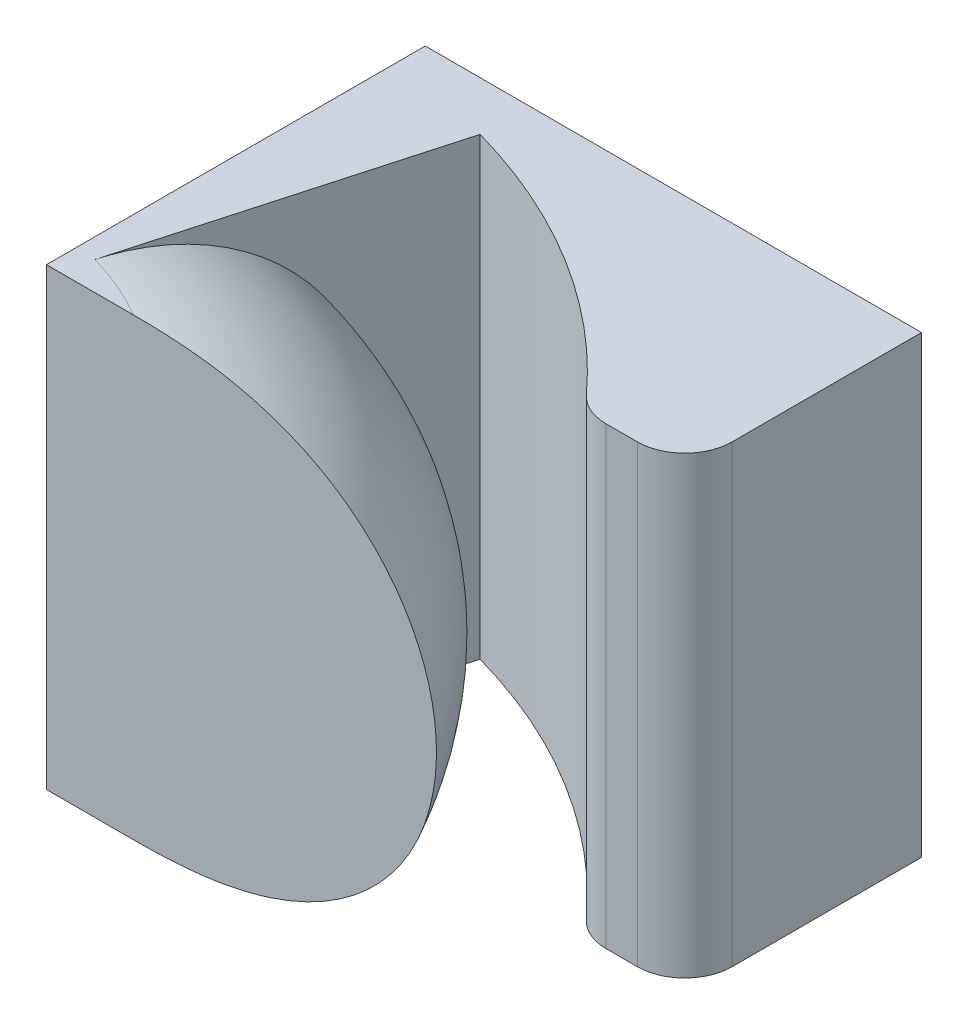
ISO-10303-21;
HEADER;
FILE_DESCRIPTION(('STEP AP214'),'2;1');
FILE_NAME('part.step','',(''),(''),'','','');
FILE_SCHEMA(('AUTOMOTIVE_DESIGN { 1 0 10303 214 1 1 1 1 }'));
ENDSEC;
DATA;
#1=APPLICATION_CONTEXT('core data for automotive mechanical design processes');
#2=APPLICATION_PROTOCOL_DEFINITION('international standard','automotive_design',2000,#1);
#3=PRODUCT_CONTEXT('',#1,'mechanical');
#4=PRODUCT('Part','Part','',(#3));
#5=PRODUCT_RELATED_PRODUCT_CATEGORY('part','',(#4));
#6=PRODUCT_DEFINITION_FORMATION('','',#4);
#7=PRODUCT_DEFINITION_CONTEXT('part definition',#1,'design');
#8=PRODUCT_DEFINITION('design','',#6,#7);
#9=PRODUCT_DEFINITION_SHAPE('','',#8);
#10=(LENGTH_UNIT() NAMED_UNIT(*) SI_UNIT(.MILLI.,.METRE.));
#11=(NAMED_UNIT(*) PLANE_ANGLE_UNIT() SI_UNIT($,.RADIAN.));
#12=(NAMED_UNIT(*) SI_UNIT($,.STERADIAN.) SOLID_ANGLE_UNIT());
#13=UNCERTAINTY_MEASURE_WITH_UNIT(LENGTH_MEASURE(1.E-05),#10,'distance_accuracy_value','');
#14=(GEOMETRIC_REPRESENTATION_CONTEXT(3) GLOBAL_UNCERTAINTY_ASSIGNED_CONTEXT((#13)) GLOBAL_UNIT_ASSIGNED_CONTEXT((#10,
#11,#12)) REPRESENTATION_CONTEXT('',''));
#15=CARTESIAN_POINT('',(0.,0.,0.));
#16=DIRECTION('',(0.,0.,1.));
#17=DIRECTION('',(1.,0.,0.));
#18=AXIS2_PLACEMENT_3D('',#15,#16,#17);
#19=CARTESIAN_POINT('',(-4.71016791571403,24.,54.4174156406722));
#20=CARTESIAN_POINT('',(-5.27005482536407,24.,53.1047949183662));
#21=CARTESIAN_POINT('',(-5.76901576654429,24.,52.0880987101162));
#22=CARTESIAN_POINT('',(-7.40660589628675,24.,49.0371312255311));
#23=CARTESIAN_POINT('',(-8.99268635291087,24.,46.8458162772862));
#24=CARTESIAN_POINT('',(-12.6754718655559,24.,43.0024173611818));
#25=CARTESIAN_POINT('',(-14.7414143760531,24.,41.3604226096504));
#26=CARTESIAN_POINT('',(-19.2517447823683,24.,38.6796599592442));
#27=CARTESIAN_POINT('',(-21.6643200628094,24.,37.6518689018373));
#28=CARTESIAN_POINT('',(-24.6725841187333,24.,36.8101417771892));
#29=CARTESIAN_POINT('',(-25.3661956648907,24.,36.6349138030031));
#30=CARTESIAN_POINT('',(-26.8098678951183,24.,36.3282053579318));
#31=CARTESIAN_POINT('',(-27.4924899255827,24.,36.1976048050057));
#32=CARTESIAN_POINT('',(-29.0079207203546,24.,35.9377611325429));
#33=CARTESIAN_POINT('',(-29.7761456367745,24.,35.8228215415974));
#34=CARTESIAN_POINT('',(-30.5418990481113,24.,35.7253963453148));
#35=CARTESIAN_POINT('',(9.75452794311762,24.,47.5783679210332));
#36=CARTESIAN_POINT('',(9.16204061197921,23.9999999999893,46.1968231293004));
#37=CARTESIAN_POINT('',(8.54959443107939,23.9999999999973,44.9329791196848));
#38=CARTESIAN_POINT('',(5.9982738253789,24.0000000000084,40.1796552817696));
#39=CARTESIAN_POINT('',(3.56332674649019,24.0000000000084,36.8248538745915));
#40=CARTESIAN_POINT('',(-2.11027866995525,23.9999999999916,30.9007709786547));
#41=CARTESIAN_POINT('',(-5.33816918219462,24.0000000000625,28.335446555197));
#42=CARTESIAN_POINT('',(-12.2871932178729,24.0000000000789,24.2074174795956));
#43=CARTESIAN_POINT('',(-15.9839556701884,23.9999999999919,22.6267377641538));
#44=CARTESIAN_POINT('',(-20.6707487354631,24.0000000000018,21.3153499385741));
#45=CARTESIAN_POINT('',(-21.5869887851796,23.9999999999988,21.0870461091565));
#46=CARTESIAN_POINT('',(-23.2599666358186,24.000000000002,20.7266660074943));
#47=CARTESIAN_POINT('',(-23.991783584877,24.,20.5852680777272));
#48=CARTESIAN_POINT('',(-25.5105776333262,24.,20.3246706536647));
#49=CARTESIAN_POINT('',(-26.2759363030982,23.9999999999866,20.2102543276948));
#50=CARTESIAN_POINT('',(-27.0429190010063,24.,20.1126727318654));
#51=CARTESIAN_POINT('',(27.8353977666572,12.,39.0295582714846));
#52=CARTESIAN_POINT('',(27.2021584929589,12.0000000000067,37.5618512843462));
#53=CARTESIAN_POINT('',(26.4478571781077,11.999999999996,35.9890796316548));
#54=CARTESIAN_POINT('',(22.7543734774652,12.0000000000125,29.1078103520384));
#55=CARTESIAN_POINT('',(19.2583431207781,12.0000000000042,24.2986508712356));
#56=CARTESIAN_POINT('',(11.096212824509,11.9999999999958,15.7737130004833));
#57=CARTESIAN_POINT('',(6.41588731018894,12.0000000000713,12.0542264870076));
#58=CARTESIAN_POINT('',(-3.58150376217878,12.0000000000878,6.11711437992878));
#59=CARTESIAN_POINT('',(-8.88350017945063,11.9999999999959,3.84532384205558));
#60=CARTESIAN_POINT('',(-15.6684545063665,12.0000000000009,1.9468601403038));
#61=CARTESIAN_POINT('',(-16.8629801855233,11.9999999999979,1.6522114918527));
#62=CARTESIAN_POINT('',(-18.8225900617061,12.0000000000027,1.22474181944225));
#63=CARTESIAN_POINT('',(-19.6159006590349,11.999999999998,1.06984716861948));
#64=CARTESIAN_POINT('',(-21.1388987745007,12.000000000002,0.808307555076578));
#65=CARTESIAN_POINT('',(-21.9006746360384,11.9999999999766,0.694545310352749));
#66=CARTESIAN_POINT('',(-22.6691939421252,12.,0.596768215053585));
#67=CARTESIAN_POINT('',(27.8353977666572,-12.,39.0295582714846));
#68=CARTESIAN_POINT('',(27.2021584929316,-11.9999999999786,37.5618512843521));
#69=CARTESIAN_POINT('',(26.447857178113,-12.000000000004,35.9890796316602));
#70=CARTESIAN_POINT('',(22.7543734774484,-11.9999999999875,29.1078103520216));
#71=CARTESIAN_POINT('',(19.2583431208032,-12.0000000000125,24.298650871269));
#72=CARTESIAN_POINT('',(11.0962128244839,-11.9999999999875,15.7737130004499));
#73=CARTESIAN_POINT('',(6.41588731018894,-12.0000000000755,12.0542264870076));
#74=CARTESIAN_POINT('',(-3.58150376217878,-12.0000000000837,6.11711437992878));
#75=CARTESIAN_POINT('',(-8.88350017953178,-11.9999999999878,3.84532384202312));
#76=CARTESIAN_POINT('',(-15.6684545063481,-12.0000000000028,1.94686014031116));
#77=CARTESIAN_POINT('',(-16.8629801854827,-12.0000000000034,1.65221149186375));
#78=CARTESIAN_POINT('',(-18.8225900617353,-11.9999999999987,1.22474181943427));
#79=CARTESIAN_POINT('',(-19.6159006591205,-12.000000000002,1.06984716860077));
#80=CARTESIAN_POINT('',(-21.1388987744152,-11.999999999998,0.808307555095281));
#81=CARTESIAN_POINT('',(-21.9006746361035,-11.9999999999987,0.694545310344979));
#82=CARTESIAN_POINT('',(-22.6691939421252,-12.,0.596768215053578));
#83=CARTESIAN_POINT('',(9.75452794311767,-24.,47.5783679210333));
#84=CARTESIAN_POINT('',(9.16204061195063,-23.999999999984,46.1968231293019));
#85=CARTESIAN_POINT('',(8.5495944310874,-24.0000000000027,44.9329791196955));
#86=CARTESIAN_POINT('',(5.99827382535381,-23.9999999999917,40.1796552817361));
#87=CARTESIAN_POINT('',(3.56332674654871,-24.0000000000084,36.8248538746584));
#88=CARTESIAN_POINT('',(-2.11027867001382,-23.9999999999916,30.9007709785878));
#89=CARTESIAN_POINT('',(-5.33816918219462,-24.0000000000625,28.335446555197));
#90=CARTESIAN_POINT('',(-12.2871932178729,-24.0000000000789,24.2074174795956));
#91=CARTESIAN_POINT('',(-15.9839556703507,-23.9999999999919,22.6267377640889));
#92=CARTESIAN_POINT('',(-20.6707487354263,-24.0000000000018,21.3153499385888));
#93=CARTESIAN_POINT('',(-21.5869887850984,-24.0000000000006,21.0870461091786));
#94=CARTESIAN_POINT('',(-23.2599666358771,-24.0000000000006,20.7266660074783));
#95=CARTESIAN_POINT('',(-23.9917835850481,-24.,20.5852680776898));
#96=CARTESIAN_POINT('',(-25.5105776331553,-24.,20.3246706537021));
#97=CARTESIAN_POINT('',(-26.2759363032282,-23.9999999999933,20.2102543276782));
#98=CARTESIAN_POINT('',(-27.0429190010064,-24.,20.1126727318654));
#99=CARTESIAN_POINT('',(-4.71016791571399,-24.,54.4174156406722));
#100=CARTESIAN_POINT('',(-5.2700548253937,-24.,53.1047949183681));
#101=CARTESIAN_POINT('',(-5.76901576653627,-24.,52.0880987101269));
#102=CARTESIAN_POINT('',(-7.40660589631184,-24.,49.0371312254977));
#103=CARTESIAN_POINT('',(-8.99268635285235,-24.,46.8458162773531));
#104=CARTESIAN_POINT('',(-12.6754718656145,-24.,43.0024173611149));
#105=CARTESIAN_POINT('',(-14.7414143760531,-24.,41.3604226096504));
#106=CARTESIAN_POINT('',(-19.2517447823683,-24.,38.6796599592442));
#107=CARTESIAN_POINT('',(-21.6643200629717,-24.,37.6518689017723));
#108=CARTESIAN_POINT('',(-24.6725841186965,-24.,36.8101417772039));
#109=CARTESIAN_POINT('',(-25.3661956648096,-24.,36.6349138030252));
#110=CARTESIAN_POINT('',(-26.8098678951768,-24.,36.3282053579159));
#111=CARTESIAN_POINT('',(-27.4924899257539,-24.,36.1976048049683));
#112=CARTESIAN_POINT('',(-29.0079207201836,-24.,35.9377611325803));
#113=CARTESIAN_POINT('',(-29.7761456369045,-24.,35.8228215415808));
#114=CARTESIAN_POINT('',(-30.5418990481114,-24.,35.7253963453148));
#115=(BOUNDED_SURFACE() B_SPLINE_SURFACE(5,3,((#19,#20,#21,#22,#23,#24,#25,#26,#27,#28,#29,#30,
#31,#32,#33,#34),(#35,#36,#37,#38,#39,#40,#41,#42,#43,#44,#45,#46,#47,#48,#49,#50),(#51,#52,#53,
#54,#55,#56,#57,#58,#59,#60,#61,#62,#63,#64,#65,#66),(#67,#68,#69,#70,#71,#72,#73,#74,#75,#76,
#77,#78,#79,#80,#81,#82),(#83,#84,#85,#86,#87,#88,#89,#90,#91,#92,#93,#94,#95,#96,#97,#98),(#99,
#100,#101,#102,#103,#104,#105,#106,#107,#108,#109,#110,#111,#112,#113,#114)),.UNSPECIFIED.,.F.,
.F.,.F.) B_SPLINE_SURFACE_WITH_KNOTS((6,6),(4,2,2,2,2,2,2,4),(0.,1.),(-0.107384987562366,0.,
0.336639506012491,0.673279012024983,1.,1.07384987562366,1.12754236940485,1.18123486318603),
.UNSPECIFIED.) GEOMETRIC_REPRESENTATION_ITEM() RATIONAL_B_SPLINE_SURFACE(((1.,1.,1.,1.,1.,1.,1.,
1.,1.,1.,1.,1.,1.,1.,1.,1.),(0.6,0.6,0.6,0.6,0.6,0.6,0.59999999999823,0.59999999999823,0.6,0.6,
0.599999999999985,0.599999999999985,0.6,0.6,0.6,0.6),(0.4,0.4,0.4,0.4,0.4,0.4,0.399999999997344,
0.399999999997344,0.4,0.4,0.399999999999977,0.399999999999977,0.4,0.4,0.4,0.4),(0.4,0.4,0.4,0.4,
0.4,0.4,0.399999999997344,0.399999999997344,0.4,0.4,0.399999999999977,0.399999999999977,0.4,0.4,
0.4,0.4),(0.6,0.6,0.6,0.6,0.6,0.6,0.59999999999823,0.59999999999823,0.6,0.6,0.599999999999985,
0.599999999999985,0.6,0.6,0.6,0.6),(1.,1.,1.,1.,1.,1.,1.,1.,1.,1.,1.,1.,1.,1.,1.,1.))) REPRESENTATION_ITEM('') SURFACE());
#116=CARTESIAN_POINT('',(-4.71016791571399,-24.,54.4174156406722));
#117=CARTESIAN_POINT('',(-5.2700548253937,-24.,53.1047949183681));
#118=CARTESIAN_POINT('',(-5.76901576653627,-24.,52.0880987101269));
#119=CARTESIAN_POINT('',(-7.40660589631184,-24.,49.0371312254977));
#120=CARTESIAN_POINT('',(-8.99268635285235,-24.,46.8458162773531));
#121=CARTESIAN_POINT('',(-12.6754718656145,-24.,43.0024173611149));
#122=CARTESIAN_POINT('',(-14.7414143760531,-24.,41.3604226096504));
#123=CARTESIAN_POINT('',(-19.2517447823683,-24.,38.6796599592442));
#124=CARTESIAN_POINT('',(-21.6643200629717,-24.,37.6518689017723));
#125=CARTESIAN_POINT('',(-24.6725841186965,-24.,36.8101417772039));
#126=CARTESIAN_POINT('',(-25.3661956648096,-24.,36.6349138030252));
#127=CARTESIAN_POINT('',(-26.8098678951768,-24.,36.3282053579159));
#128=CARTESIAN_POINT('',(-27.4924899257539,-24.,36.1976048049683));
#129=CARTESIAN_POINT('',(-29.0079207201836,-24.,35.9377611325803));
#130=CARTESIAN_POINT('',(-29.7761456369045,-24.,35.8228215415808));
#131=CARTESIAN_POINT('',(-30.5418990481114,-24.,35.7253963453148));
#132=(BOUNDED_CURVE() B_SPLINE_CURVE(3,(#116,#117,#118,#119,#120,#121,#122,#123,#124,#125,#126,
#127,#128,#129,#130,#131),.UNSPECIFIED.,.F.,.F.) B_SPLINE_CURVE_WITH_KNOTS((4,2,2,2,2,2,2,4),
(-0.107384987562366,0.,0.336639506012491,0.673279012024983,1.,1.07384987562366,1.12754236940485,
1.18123486318603),
.UNSPECIFIED.) CURVE() GEOMETRIC_REPRESENTATION_ITEM() RATIONAL_B_SPLINE_CURVE((1.,1.,1.,1.,1.,
1.,1.,1.,1.,1.,1.,1.,1.,1.,1.,1.)) REPRESENTATION_ITEM(''));
#133=CARTESIAN_POINT('',(-24.1179758170278,-24.,36.9653239162641));
#134=VERTEX_POINT('',#133);
#135=CARTESIAN_POINT('',(-17.0302986459175,-24.,40.));
#136=VERTEX_POINT('',#135);
#137=EDGE_CURVE('E252',#134,#136,#132,.F.);
#138=CARTESIAN_POINT('',(-24.1179758170278,-24.,36.9653239162642));
#139=CARTESIAN_POINT('',(-19.8066841806051,-24.,21.5571194645536));
#140=CARTESIAN_POINT('',(-14.4175696350769,-12.,2.29686389991545));
#141=CARTESIAN_POINT('',(-14.4175696350769,12.,2.29686389991543));
#142=CARTESIAN_POINT('',(-19.8066841806052,24.,21.5571194645536));
#143=CARTESIAN_POINT('',(-24.1179758170279,24.,36.9653239162641));
#144=(BOUNDED_CURVE() B_SPLINE_CURVE(5,(#138,#139,#140,#141,#142,#143),.UNSPECIFIED.,.F.,
.F.) B_SPLINE_CURVE_WITH_KNOTS((6,6),(0.,1.),
.UNSPECIFIED.) CURVE() GEOMETRIC_REPRESENTATION_ITEM() RATIONAL_B_SPLINE_CURVE((1.,0.6,0.4,0.4,
0.6,1.)) REPRESENTATION_ITEM(''));
#145=CARTESIAN_POINT('',(-24.1179758170278,24.,36.9653239162641));
#146=VERTEX_POINT('',#145);
#147=EDGE_CURVE('E128',#146,#134,#144,.F.);
#148=CARTESIAN_POINT('',(-30.5418990481113,24.,35.7253963453148));
#149=CARTESIAN_POINT('',(-29.7761456367745,24.,35.8228215415974));
#150=CARTESIAN_POINT('',(-29.0079207203546,24.,35.9377611325429));
#151=CARTESIAN_POINT('',(-27.4924899255827,24.,36.1976048050057));
#152=CARTESIAN_POINT('',(-26.8098678951183,24.,36.3282053579318));
#153=CARTESIAN_POINT('',(-25.3661956648907,24.,36.6349138030031));
#154=CARTESIAN_POINT('',(-24.6725841187333,24.,36.8101417771892));
#155=CARTESIAN_POINT('',(-21.6643200628094,24.,37.6518689018373));
#156=CARTESIAN_POINT('',(-19.2517447823683,24.,38.6796599592442));
#157=CARTESIAN_POINT('',(-14.7414143760531,24.,41.3604226096504));
#158=CARTESIAN_POINT('',(-12.6754718655559,24.,43.0024173611818));
#159=CARTESIAN_POINT('',(-8.99268635291087,24.,46.8458162772862));
#160=CARTESIAN_POINT('',(-7.40660589628675,24.,49.0371312255311));
#161=CARTESIAN_POINT('',(-5.76901576654429,24.,52.0880987101162));
#162=CARTESIAN_POINT('',(-5.27005482536407,24.,53.1047949183662));
#163=CARTESIAN_POINT('',(-4.71016791571403,24.,54.4174156406722));
#164=(BOUNDED_CURVE() B_SPLINE_CURVE(3,(#148,#149,#150,#151,#152,#153,#154,#155,#156,#157,#158,
#159,#160,#161,#162,#163),.UNSPECIFIED.,.F.,.F.) B_SPLINE_CURVE_WITH_KNOTS((4,2,2,2,2,2,2,4),
(-0.107384987562366,-0.0536924937811831,0.,0.0738498756236627,0.40057086359868,
0.737210369611172,1.07384987562366,1.18123486318603),
.UNSPECIFIED.) CURVE() GEOMETRIC_REPRESENTATION_ITEM() RATIONAL_B_SPLINE_CURVE((1.,1.,1.,1.,1.,
1.,1.,1.,1.,1.,1.,1.,1.,1.,1.,1.)) REPRESENTATION_ITEM(''));
#165=CARTESIAN_POINT('',(-17.0302986457471,24.,40.));
#166=VERTEX_POINT('',#165);
#167=EDGE_CURVE('E165',#166,#146,#164,.F.);
#168=CARTESIAN_POINT('',(-17.0302986457905,24.,40.0000000000733));
#169=CARTESIAN_POINT('',(-16.1644996832486,24.0000857948899,40.0000989992136));
#170=CARTESIAN_POINT('',(-15.2982382123024,23.9877939427651,40.0005160881803));
#171=CARTESIAN_POINT('',(-13.5327217107944,23.9285043746845,40.001376924711));
#172=CARTESIAN_POINT('',(-12.6335140141017,23.8801559127451,40.0018210747047));
#173=CARTESIAN_POINT('',(-11.2702926318957,23.7716593624574,40.0019697989966));
#174=CARTESIAN_POINT('',(-10.8049528704081,23.7283675044395,40.0019273216198));
#175=CARTESIAN_POINT('',(-9.86207930953182,23.6266361864235,40.0016842571246));
#176=CARTESIAN_POINT('',(-9.38458908570482,23.5677889236964,40.0014790597406));
#177=CARTESIAN_POINT('',(-8.416493168563,23.4321868863049,40.0009912146743));
#178=CARTESIAN_POINT('',(-7.92595908433239,23.3549174304994,40.0007062900602));
#179=CARTESIAN_POINT('',(-6.93112928689655,23.1793316477198,40.0001873362531));
#180=CARTESIAN_POINT('',(-6.42694492771486,23.0803794018241,39.9999554100463));
#181=CARTESIAN_POINT('',(-5.49682034431617,22.8780024232116,40.0000380361861));
#182=CARTESIAN_POINT('',(-5.07027165237416,22.7773726858346,40.0002772781295));
#183=CARTESIAN_POINT('',(-4.21375542790418,22.5584793507755,40.0009249498853));
#184=CARTESIAN_POINT('',(-3.78385854951048,22.4399381583427,40.001336265167));
#185=CARTESIAN_POINT('',(-2.92124716444559,22.1835078963742,40.0020783995394));
#186=CARTESIAN_POINT('',(-2.48862629276785,22.0453030359022,40.0024075987347));
#187=CARTESIAN_POINT('',(-1.6213642963441,21.7477512248954,40.0028615252165));
#188=CARTESIAN_POINT('',(-1.18684512116715,21.5880479344405,40.0029821866281));
#189=CARTESIAN_POINT('',(-0.316826051316081,21.2456564775207,40.0029736070605));
#190=CARTESIAN_POINT('',(0.118517586916658,21.0625704163697,40.0028392878277));
#191=CARTESIAN_POINT('',(0.988872707372866,20.6715493038597,40.0023724251945));
#192=CARTESIAN_POINT('',(1.42368726180994,20.4631750464913,40.0020357994184));
#193=CARTESIAN_POINT('',(2.29135606592329,20.0197254029624,40.0012866930284));
#194=CARTESIAN_POINT('',(2.72396598680997,19.7841712441339,40.0008727336127));
#195=CARTESIAN_POINT('',(3.58528099457577,19.284587103109,40.000251495007));
#196=CARTESIAN_POINT('',(4.01368843428267,19.0200428056821,40.0000489862116));
#197=CARTESIAN_POINT('',(4.81236484056924,18.4948506231412,39.999955949328));
#198=CARTESIAN_POINT('',(5.18414257897818,18.2364956281938,40.0000360437722));
#199=CARTESIAN_POINT('',(5.91745484696259,17.6975890690435,40.0001844311617));
#200=CARTESIAN_POINT('',(6.27883613710342,17.4168286006517,40.0002525878652));
#201=CARTESIAN_POINT('',(6.98941121312907,16.8328198815751,40.0003845906144));
#202=CARTESIAN_POINT('',(7.33843472369428,16.5293644046325,40.000448383169));
#203=CARTESIAN_POINT('',(8.02225375897534,15.8998139578739,40.0005326839744));
#204=CARTESIAN_POINT('',(8.35686295576284,15.5735158986797,40.0005527339099));
#205=CARTESIAN_POINT('',(8.8451873691633,15.068518850507,40.0005488319176));
#206=CARTESIAN_POINT('',(9.00628876715931,14.8969062698749,40.0005417751843));
#207=CARTESIAN_POINT('',(9.3240887943153,14.5480674214161,40.0005169235237));
#208=CARTESIAN_POINT('',(9.48076139133972,14.3708173814594,40.0004990750984));
#209=CARTESIAN_POINT('',(9.7894133054607,14.0107652567126,40.000454466436));
#210=CARTESIAN_POINT('',(9.94136578821857,13.827940176438,40.0004276628536));
#211=CARTESIAN_POINT('',(10.2402935052756,13.4568091650839,40.0003679380666));
#212=CARTESIAN_POINT('',(10.3872412380589,13.2684810747629,40.0003349880149));
#213=CARTESIAN_POINT('',(10.6758715314815,12.8864355284467,40.0002666870945));
#214=CARTESIAN_POINT('',(10.8175260123406,12.6926968550588,40.0002313256423));
#215=CARTESIAN_POINT('',(11.0952824804048,12.2999396792352,40.0001630225135));
#216=CARTESIAN_POINT('',(11.2313559260144,12.1009009877108,40.0001300927173));
#217=CARTESIAN_POINT('',(11.497663606681,11.6976725615059,40.000071679374));
#218=CARTESIAN_POINT('',(11.627868959542,11.4934637490016,40.0000462298376));
#219=CARTESIAN_POINT('',(11.8821579049809,11.0800430341896,40.0000112223543));
#220=CARTESIAN_POINT('',(12.0062124159351,10.8708132378511,40.0000017339911));
#221=CARTESIAN_POINT('',(12.2412593393311,10.4591756617826,39.9999983544156));
#222=CARTESIAN_POINT('',(12.3525952466647,10.2569639413621,40.0000036926542));
#223=CARTESIAN_POINT('',(12.5691956200154,9.84857932803517,40.0000181814018));
#224=CARTESIAN_POINT('',(12.6744420007783,9.64239683971462,40.0000273426633));
#225=CARTESIAN_POINT('',(12.8786515993114,9.22625577058013,40.000048901735));
#226=CARTESIAN_POINT('',(12.9775971845964,9.01628853603016,40.0000613081709));
#227=CARTESIAN_POINT('',(13.1690009577651,8.59277598561921,40.0000867041861));
#228=CARTESIAN_POINT('',(13.2614420655938,8.37922294910216,40.0000996951637));
#229=CARTESIAN_POINT('',(13.4396420739581,7.94875092118051,40.0001246473765));
#230=CARTESIAN_POINT('',(13.5253845484691,7.73182512886617,40.0001366060876));
#231=CARTESIAN_POINT('',(13.6900027932337,7.29483288322661,40.0001580870596));
#232=CARTESIAN_POINT('',(13.7688628912066,7.07476052504142,40.0001676038509));
#233=CARTESIAN_POINT('',(13.919543333348,6.63171310472891,40.0001832295864));
#234=CARTESIAN_POINT('',(13.9913488564589,6.40873300112867,40.0001893314773));
#235=CARTESIAN_POINT('',(14.1277595649363,5.96011995859079,40.0001975338969));
#236=CARTESIAN_POINT('',(14.192350874469,5.73448279971033,40.0001996268353));
#237=CARTESIAN_POINT('',(14.314186022906,5.2808166171877,40.0001996144732));
#238=CARTESIAN_POINT('',(14.3714170207118,5.05278414442519,40.0001975019387));
#239=CARTESIAN_POINT('',(14.4783987804472,4.5945984935586,40.0001892753879));
#240=CARTESIAN_POINT('',(14.5281378199954,4.36444257796021,40.0001831551792));
#241=CARTESIAN_POINT('',(14.6200181098862,3.9022903921082,40.0001675049252));
#242=CARTESIAN_POINT('',(14.6621488340322,3.67029202881696,40.0001579702093));
#243=CARTESIAN_POINT('',(14.7387109121218,3.20474341118302,40.0001364755589));
#244=CARTESIAN_POINT('',(14.7731330060794,2.97119163374826,40.0001245127402));
#245=CARTESIAN_POINT('',(14.834192883488,2.50283161307313,40.0000995366127));
#246=CARTESIAN_POINT('',(14.8608227348954,2.26802233557856,40.0000865222507));
#247=CARTESIAN_POINT('',(14.906230394982,1.79744849114775,40.0000612014642));
#248=CARTESIAN_POINT('',(14.9250016522354,1.5616832919447,40.0000488956377));
#249=CARTESIAN_POINT('',(14.9546420625301,1.08950325436828,40.0000271313806));
#250=CARTESIAN_POINT('',(14.9655060877274,0.853088094053591,40.0000176748));
#251=CARTESIAN_POINT('',(14.9792999839244,0.379916991536058,40.0000041033806));
#252=CARTESIAN_POINT('',(14.9822261833667,0.143160942297075,39.9999999910142));
#253=CARTESIAN_POINT('',(14.9801292257424,-0.330702544190621,40.0000000090005));
#254=CARTESIAN_POINT('',(14.9750930827339,-0.567809924068686,40.0000041528212));
#255=CARTESIAN_POINT('',(14.957058154904,-1.04159730979613,40.0000178632647));
#256=CARTESIAN_POINT('',(14.9440635397269,-1.27827747439199,40.0000274270476));
#257=CARTESIAN_POINT('',(14.9101460115621,-1.75090026268962,40.0000494335216));
#258=CARTESIAN_POINT('',(14.889228727147,-1.98684329037764,40.0000618741665));
#259=CARTESIAN_POINT('',(14.8395183392025,-2.45768499696251,40.0000874748071));
#260=CARTESIAN_POINT('',(14.8107322869058,-2.69258442042409,40.0001006341503));
#261=CARTESIAN_POINT('',(14.7453546053597,-3.16103681523905,40.0001258896057));
#262=CARTESIAN_POINT('',(14.7087714035203,-3.39459096290953,40.0001379868459));
#263=CARTESIAN_POINT('',(14.6278869534923,-3.86005667316016,40.000159724765));
#264=CARTESIAN_POINT('',(14.5835954527734,-4.09196992983167,40.000169368509));
#265=CARTESIAN_POINT('',(14.4873986385592,-4.55386491643722,40.0001851998327));
#266=CARTESIAN_POINT('',(14.435504327544,-4.78384893817065,40.0001913923458));
#267=CARTESIAN_POINT('',(14.3242221437631,-5.24160485819252,40.0001997193443));
#268=CARTESIAN_POINT('',(14.2648464553086,-5.46937971900683,40.0002018603393));
#269=CARTESIAN_POINT('',(14.1387370069908,-5.92244614595919,40.0002018824328));
#270=CARTESIAN_POINT('',(14.0720165328497,-6.14774141073054,40.0001997711072));
#271=CARTESIAN_POINT('',(13.9313673808845,-6.59558789733958,40.0001914859636));
#272=CARTESIAN_POINT('',(13.8574530034942,-6.81814361106053,40.0001853200704));
#273=CARTESIAN_POINT('',(13.7025793561917,-7.26026158159487,40.0001695261128));
#274=CARTESIAN_POINT('',(13.6216353094592,-7.47982917196265,40.0001599053951));
#275=CARTESIAN_POINT('',(13.4528780753033,-7.91573362227761,40.0001381863916));
#276=CARTESIAN_POINT('',(13.3650809376385,-8.13207669682463,40.0001260937934));
#277=CARTESIAN_POINT('',(13.1828046805536,-8.56130772828632,40.0001008595783));
#278=CARTESIAN_POINT('',(13.0883423381293,-8.77420281086853,40.0000877205854));
#279=CARTESIAN_POINT('',(12.8929330834058,-9.19632685717497,40.0000620313806));
#280=CARTESIAN_POINT('',(12.7920035740965,-9.40556387857261,40.0000494797338));
#281=CARTESIAN_POINT('',(12.5838667620932,-9.82017511867226,40.0000276704588));
#282=CARTESIAN_POINT('',(12.4766773855327,-10.0255583375541,40.0000184039147));
#283=CARTESIAN_POINT('',(12.2562349737382,-10.4322784424402,40.0000037331945));
#284=CARTESIAN_POINT('',(12.1430002873884,-10.6336252768419,39.9999983179738));
#285=CARTESIAN_POINT('',(11.9045705898737,-11.0426064683214,40.000001765441));
#286=CARTESIAN_POINT('',(11.7790609279774,-11.2500574525741,40.0000113495149));
#287=CARTESIAN_POINT('',(11.5219682547276,-11.659892650338,40.0000467386236));
#288=CARTESIAN_POINT('',(11.3904143026727,-11.8622950992118,40.0000724723127));
#289=CARTESIAN_POINT('',(11.1215155347227,-12.2618894505819,40.0001315347077));
#290=CARTESIAN_POINT('',(10.9841995341412,-12.4591007467644,40.0001648286111));
#291=CARTESIAN_POINT('',(10.7040631231206,-12.848188217783,40.000233887832));
#292=CARTESIAN_POINT('',(10.5612711464555,-13.04008486908,40.0002696409911));
#293=CARTESIAN_POINT('',(10.2704696572457,-13.4184376302108,40.0003386978595));
#294=CARTESIAN_POINT('',(10.1224880795512,-13.6049152142944,40.0003720123745));
#295=CARTESIAN_POINT('',(9.82159469075277,-13.9723424032402,40.0004323971083));
#296=CARTESIAN_POINT('',(9.6687102030794,-14.1533143919798,40.000459496764));
#297=CARTESIAN_POINT('',(9.35829418261695,-14.5096631125551,40.0005045967734));
#298=CARTESIAN_POINT('',(9.20078927692075,-14.6850630313174,40.0005226413299));
#299=CARTESIAN_POINT('',(8.88142200005761,-15.0302098957833,40.0005477653243));
#300=CARTESIAN_POINT('',(8.71958542873154,-15.1999807705296,40.0005548992728));
#301=CARTESIAN_POINT('',(8.22921113061581,-15.6994780850658,40.000558835213));
#302=CARTESIAN_POINT('',(7.89341383688496,-16.0221329293013,40.000538551011));
#303=CARTESIAN_POINT('',(7.20757352866402,-16.6444858155749,40.0004533332746));
#304=CARTESIAN_POINT('',(6.85771457030468,-16.9443873890067,40.0003888653968));
#305=CARTESIAN_POINT('',(6.14579604857627,-17.5214070678554,40.0002553173466));
#306=CARTESIAN_POINT('',(5.78390435273767,-17.7987323362777,40.0001862930736));
#307=CARTESIAN_POINT('',(5.0498691553771,-18.3309127488703,40.00003659457));
#308=CARTESIAN_POINT('',(4.67787644833724,-18.5859762663904,39.9999560526536));
#309=CARTESIAN_POINT('',(3.87984947853494,-19.1038191432649,40.0000487745688));
#310=CARTESIAN_POINT('',(3.45236734731007,-19.3643686634104,40.0002508884313));
#311=CARTESIAN_POINT('',(2.59326203297151,-19.8563055611358,40.0008709134667));
#312=CARTESIAN_POINT('',(2.16193054854042,-20.0882034921775,40.0012840413152));
#313=CARTESIAN_POINT('',(1.2971187494878,-20.5246869897107,40.0020320025181));
#314=CARTESIAN_POINT('',(0.863877616057692,-20.7297471559346,40.0023683093504));
#315=CARTESIAN_POINT('',(-0.00308437108077569,-21.1144827049679,40.0028353945986));
#316=CARTESIAN_POINT('',(-0.436612633199568,-21.2945929384761,40.0029702522356));
#317=CARTESIAN_POINT('',(-1.30280224934081,-21.6313654855709,40.0029807069399));
#318=CARTESIAN_POINT('',(-1.73531091879212,-21.7884213463584,40.0028613827664));
#319=CARTESIAN_POINT('',(-2.59839472323833,-22.0809967244417,40.0024104057357));
#320=CARTESIAN_POINT('',(-3.02885078795639,-22.2168683824462,40.0020828252884));
#321=CARTESIAN_POINT('',(-3.88701102881164,-22.4689329913866,40.0013424392243));
#322=CARTESIAN_POINT('',(-4.3146238439931,-22.585437784671,40.0009312846244));
#323=CARTESIAN_POINT('',(-5.16647532692407,-22.8005388541508,40.0002817879073));
#324=CARTESIAN_POINT('',(-5.59064505458483,-22.899409265863,40.0000405884773));
#325=CARTESIAN_POINT('',(-6.51396641023625,-23.0978980220065,39.9999525644288));
#326=CARTESIAN_POINT('',(-7.01369605173653,-23.1948288678279,40.0001791331662));
#327=CARTESIAN_POINT('',(-7.99981290099678,-23.3668832188695,40.0006811050881));
#328=CARTESIAN_POINT('',(-8.48609342417345,-23.4426229796487,40.0009546410033));
#329=CARTESIAN_POINT('',(-9.44588339006506,-23.5755862096495,40.0014240190292));
#330=CARTESIAN_POINT('',(-9.91932416292807,-23.6333087055665,40.0016219971467));
#331=CARTESIAN_POINT('',(-10.8542934454763,-23.7331297017656,40.0018566379906));
#332=CARTESIAN_POINT('',(-11.3157801086489,-23.7756239569765,40.0018977052609));
#333=CARTESIAN_POINT('',(-12.6679860968448,-23.8821697407934,40.0017549081366));
#334=CARTESIAN_POINT('',(-13.5599937986487,-23.9296827556675,40.0013272125415));
#335=CARTESIAN_POINT('',(-15.3116136302397,-23.987981108426,40.0004977670853));
#336=CARTESIAN_POINT('',(-16.1711800521866,-24.0000828072321,40.0000956468086));
#337=CARTESIAN_POINT('',(-17.030298645918,-24.,39.9999999999975));
#338=B_SPLINE_CURVE_WITH_KNOTS('',3,(#168,#169,#170,#171,#172,#173,#174,#175,#176,#177,#178,
#179,#180,#181,#182,#183,#184,#185,#186,#187,#188,#189,#190,#191,#192,#193,#194,#195,#196,#197,
#198,#199,#200,#201,#202,#203,#204,#205,#206,#207,#208,#209,#210,#211,#212,#213,#214,#215,#216,
#217,#218,#219,#220,#221,#222,#223,#224,#225,#226,#227,#228,#229,#230,#231,#232,#233,#234,#235,
#236,#237,#238,#239,#240,#241,#242,#243,#244,#245,#246,#247,#248,#249,#250,#251,#252,#253,#254,
#255,#256,#257,#258,#259,#260,#261,#262,#263,#264,#265,#266,#267,#268,#269,#270,#271,#272,#273,
#274,#275,#276,#277,#278,#279,#280,#281,#282,#283,#284,#285,#286,#287,#288,#289,#290,#291,#292,
#293,#294,#295,#296,#297,#298,#299,#300,#301,#302,#303,#304,#305,#306,#307,#308,#309,#310,#311,
#312,#313,#314,#315,#316,#317,#318,#319,#320,#321,#322,#323,#324,#325,#326,#327,#328,#329,#330,
#331,#332,#333,#334,#335,#336,#337),.UNSPECIFIED.,.F.,.F.,(4,2,2,2,2,2,2,2,2,2,2,2,2,2,2,2,2,2,
2,2,2,2,2,2,2,2,2,2,2,2,2,2,2,2,2,2,2,2,2,2,2,2,2,2,2,2,2,2,2,2,2,2,2,2,2,2,2,2,2,2,2,2,2,2,2,2,
2,2,2,2,2,2,2,2,2,2,2,2,2,2,2,2,2,2,4),(0.,2.59806200341701,5.29867373283847,6.70053848560301,
8.14360504522311,9.63304376770792,11.1740361476967,12.4885356742209,13.826022182066,
15.1881115966599,16.5764701678488,17.9927699906455,19.4386569684818,20.9157136531205,
22.4254170960837,23.7830124087399,25.1552138822484,26.5419940658347,27.9432358874648,
28.6492946624172,29.3588826459424,30.0719562157444,30.7884646921782,31.508350177208,
32.2315474206604,32.9579837152367,33.687578821612,34.3799758633131,35.0743335661377,
35.7705559689802,36.4685431617324,37.1681914412898,37.8693934829487,38.5720385263332,
39.2760125749706,39.9811986086175,40.687476807443,41.3947247871802,42.1028178443753,
42.8116292108783,43.5210303167361,44.230891060657,44.9410800872188,45.6524285704403,
46.3634046787045,47.0738766264171,47.783713992872,48.4927880000548,49.2009717832494,
49.9081406536113,50.614172351872,51.3189472923265,52.022348796242,52.7242633138093,
53.4245806337483,54.1231940796701,54.8200006923047,55.5149013967182,56.2078011536762,
56.9350630939658,57.6591345376856,58.3799380639856,59.0974037671051,59.8114691700631,
60.5220791088336,61.2291855883953,61.9327476121784,63.328962752458,64.7106848326927,
66.0778148620432,67.4303418928591,68.931431904153,70.3999125070609,71.837277968555,
73.2451232985276,74.6251028853075,75.9788941121301,77.3081660628421,78.6145194553905,
80.1412488002697,81.6173807939519,83.0479866619401,84.4381266172528,87.1170613710519,
89.6950603130957),.UNSPECIFIED.);
#339=EDGE_CURVE('E253',#136,#166,#338,.F.);
#340=ORIENTED_EDGE('',*,*,#137,.F.);
#341=ORIENTED_EDGE('',*,*,#147,.F.);
#342=ORIENTED_EDGE('',*,*,#167,.F.);
#343=ORIENTED_EDGE('',*,*,#339,.F.);
#344=EDGE_LOOP('',(#340,#341,#342,#343));
#345=FACE_BOUND('',#344,.T.);
#346=ADVANCED_FACE('F39',(#345),#115,.T.);
#347=CARTESIAN_POINT('',(26.2021140749149,24.,40.));
#348=DIRECTION('',(-1.,0.,0.));
#349=DIRECTION('',(0.,-1.,0.));
#350=AXIS2_PLACEMENT_3D('',#347,#348,#349);
#351=PLANE('',#350);
#352=DIRECTION('',(0.,0.,-1.));
#353=VECTOR('',#352,1.);
#354=CARTESIAN_POINT('',(26.2021140749149,24.,40.));
#355=LINE('',#354,#353);
#356=CARTESIAN_POINT('',(26.2021140749149,24.,20.0029961438488));
#357=VERTEX_POINT('',#356);
#358=CARTESIAN_POINT('',(26.2021140749149,24.,0.));
#359=VERTEX_POINT('',#358);
#360=EDGE_CURVE('E256',#357,#359,#355,.T.);
#361=ORIENTED_EDGE('',*,*,#360,.F.);
#362=DIRECTION('',(0.,-1.,0.));
#363=VECTOR('',#362,1.);
#364=CARTESIAN_POINT('',(26.2021140749149,24.,20.0029961438488));
#365=LINE('',#364,#363);
#366=CARTESIAN_POINT('',(26.2021140749149,-24.,20.0029961438488));
#367=VERTEX_POINT('',#366);
#368=EDGE_CURVE('E288',#357,#367,#365,.T.);
#369=ORIENTED_EDGE('',*,*,#368,.T.);
#370=DIRECTION('',(0.,0.,-1.));
#371=VECTOR('',#370,1.);
#372=CARTESIAN_POINT('',(26.2021140749149,-24.,40.));
#373=LINE('',#372,#371);
#374=CARTESIAN_POINT('',(26.2021140749149,-24.,0.));
#375=VERTEX_POINT('',#374);
#376=EDGE_CURVE('E267',#367,#375,#373,.T.);
#377=ORIENTED_EDGE('',*,*,#376,.T.);
#378=DIRECTION('',(0.,1.,0.));
#379=VECTOR('',#378,1.);
#380=CARTESIAN_POINT('',(26.2021140749149,24.,0.));
#381=LINE('',#380,#379);
#382=EDGE_CURVE('E147',#375,#359,#381,.T.);
#383=ORIENTED_EDGE('',*,*,#382,.T.);
#384=EDGE_LOOP('',(#361,#369,#377,#383));
#385=FACE_BOUND('',#384,.T.);
#386=ADVANCED_FACE('F182',(#385),#351,.F.);
#387=CARTESIAN_POINT('',(-26.2021140749149,24.,40.));
#388=DIRECTION('',(0.,-1.,0.));
#389=DIRECTION('',(0.,0.,-1.));
#390=AXIS2_PLACEMENT_3D('',#387,#388,#389);
#391=PLANE('',#390);
#392=DIRECTION('',(-1.,0.,0.));
#393=VECTOR('',#392,1.);
#394=CARTESIAN_POINT('',(15.6114012191346,24.,25.0029961438488));
#395=LINE('',#394,#393);
#396=CARTESIAN_POINT('',(21.2021140749149,24.,25.0029961438488));
#397=VERTEX_POINT('',#396);
#398=CARTESIAN_POINT('',(17.8794170739098,24.,25.0029961438488));
#399=VERTEX_POINT('',#398);
#400=EDGE_CURVE('E122',#397,#399,#395,.T.);
#401=ORIENTED_EDGE('',*,*,#400,.F.);
#402=CARTESIAN_POINT('',(21.2021140749149,24.,20.0029961438488));
#403=DIRECTION('',(0.,-1.,0.));
#404=DIRECTION('',(0.,0.,-1.));
#405=AXIS2_PLACEMENT_3D('',#402,#403,#404);
#406=CIRCLE('',#405,5.);
#407=EDGE_CURVE('E47',#397,#357,#406,.F.);
#408=ORIENTED_EDGE('',*,*,#407,.T.);
#409=ORIENTED_EDGE('',*,*,#360,.T.);
#410=DIRECTION('',(-1.,0.,0.));
#411=VECTOR('',#410,1.);
#412=CARTESIAN_POINT('',(-26.2021140749149,24.,0.));
#413=LINE('',#412,#411);
#414=CARTESIAN_POINT('',(-26.2021140749149,24.,0.));
#415=VERTEX_POINT('',#414);
#416=EDGE_CURVE('E272',#359,#415,#413,.T.);
#417=ORIENTED_EDGE('',*,*,#416,.T.);
#418=DIRECTION('',(0.,0.,-1.));
#419=VECTOR('',#418,1.);
#420=CARTESIAN_POINT('',(-26.2021140749149,24.,40.));
#421=LINE('',#420,#419);
#422=CARTESIAN_POINT('',(-26.2021140749149,24.,40.));
#423=VERTEX_POINT('',#422);
#424=EDGE_CURVE('E257',#423,#415,#421,.T.);
#425=ORIENTED_EDGE('',*,*,#424,.F.);
#426=DIRECTION('',(-1.,0.,0.));
#427=VECTOR('',#426,1.);
#428=CARTESIAN_POINT('',(-26.2021140749149,24.,40.));
#429=LINE('',#428,#427);
#430=EDGE_CURVE('E153',#166,#423,#429,.T.);
#431=ORIENTED_EDGE('',*,*,#430,.F.);
#432=ORIENTED_EDGE('',*,*,#167,.T.);
#433=DIRECTION('',(-0.269455727276413,0.,0.963012778231909));
#434=VECTOR('',#433,1.);
#435=CARTESIAN_POINT('',(-15.2259368169062,24.,5.18590223461115));
#436=LINE('',#435,#434);
#437=CARTESIAN_POINT('',(-15.2259368169062,24.,5.18590223461115));
#438=VERTEX_POINT('',#437);
#439=EDGE_CURVE('E139',#438,#146,#436,.T.);
#440=ORIENTED_EDGE('',*,*,#439,.F.);
#441=CARTESIAN_POINT('',(-32.0269879299683,24.,65.2314877307726));
#442=DIRECTION('',(0.,-1.,0.));
#443=DIRECTION('',(0.,0.,-1.));
#444=AXIS2_PLACEMENT_3D('',#441,#442,#443);
#445=CIRCLE('',#444,62.3518055558984);
#446=CARTESIAN_POINT('',(14.1745123136017,24.,23.3606263672425));
#447=VERTEX_POINT('',#446);
#448=EDGE_CURVE('E119',#447,#438,#445,.F.);
#449=ORIENTED_EDGE('',*,*,#448,.F.);
#450=CARTESIAN_POINT('',(17.8794170739098,24.,20.0029961438488));
#451=DIRECTION('',(0.,-1.,0.));
#452=DIRECTION('',(0.,0.,-1.));
#453=AXIS2_PLACEMENT_3D('',#450,#451,#452);
#454=CIRCLE('',#453,5.);
#455=EDGE_CURVE('E59',#447,#399,#454,.F.);
#456=ORIENTED_EDGE('',*,*,#455,.T.);
#457=EDGE_LOOP('',(#401,#408,#409,#417,#425,#431,#432,#440,#449,#456));
#458=FACE_BOUND('',#457,.T.);
#459=ADVANCED_FACE('F171',(#458),#391,.F.);
#460=CARTESIAN_POINT('',(-26.2021140749149,24.,40.));
#461=DIRECTION('',(1.,0.,0.));
#462=DIRECTION('',(0.,1.,0.));
#463=AXIS2_PLACEMENT_3D('',#460,#461,#462);
#464=PLANE('',#463);
#465=DIRECTION('',(0.,-1.,0.));
#466=VECTOR('',#465,1.);
#467=CARTESIAN_POINT('',(-26.2021140749149,24.,0.));
#468=LINE('',#467,#466);
#469=CARTESIAN_POINT('',(-26.2021140749149,-24.,0.));
#470=VERTEX_POINT('',#469);
#471=EDGE_CURVE('E274',#415,#470,#468,.T.);
#472=ORIENTED_EDGE('',*,*,#471,.T.);
#473=DIRECTION('',(0.,0.,-1.));
#474=VECTOR('',#473,1.);
#475=CARTESIAN_POINT('',(-26.2021140749149,-24.,40.));
#476=LINE('',#475,#474);
#477=CARTESIAN_POINT('',(-26.2021140749149,-24.,40.));
#478=VERTEX_POINT('',#477);
#479=EDGE_CURVE('E262',#478,#470,#476,.T.);
#480=ORIENTED_EDGE('',*,*,#479,.F.);
#481=DIRECTION('',(0.,-1.,0.));
#482=VECTOR('',#481,1.);
#483=CARTESIAN_POINT('',(-26.2021140749149,24.,40.));
#484=LINE('',#483,#482);
#485=EDGE_CURVE('E150',#423,#478,#484,.T.);
#486=ORIENTED_EDGE('',*,*,#485,.F.);
#487=ORIENTED_EDGE('',*,*,#424,.T.);
#488=EDGE_LOOP('',(#472,#480,#486,#487));
#489=FACE_BOUND('',#488,.T.);
#490=ADVANCED_FACE('F181',(#489),#464,.F.);
#491=CARTESIAN_POINT('',(-26.2021140749149,-24.,40.));
#492=DIRECTION('',(0.,1.,0.));
#493=DIRECTION('',(0.,0.,1.));
#494=AXIS2_PLACEMENT_3D('',#491,#492,#493);
#495=PLANE('',#494);
#496=ORIENTED_EDGE('',*,*,#376,.F.);
#497=CARTESIAN_POINT('',(21.2021140749149,-24.,20.0029961438488));
#498=DIRECTION('',(0.,1.,0.));
#499=DIRECTION('',(0.,0.,1.));
#500=AXIS2_PLACEMENT_3D('',#497,#498,#499);
#501=CIRCLE('',#500,5.);
#502=CARTESIAN_POINT('',(21.2021140749149,-24.,25.0029961438488));
#503=VERTEX_POINT('',#502);
#504=EDGE_CURVE('E289',#367,#503,#501,.F.);
#505=ORIENTED_EDGE('',*,*,#504,.T.);
#506=DIRECTION('',(1.,0.,0.));
#507=VECTOR('',#506,1.);
#508=CARTESIAN_POINT('',(15.6114012191346,-24.,25.0029961438488));
#509=LINE('',#508,#507);
#510=CARTESIAN_POINT('',(17.8794170739098,-24.,25.0029961438488));
#511=VERTEX_POINT('',#510);
#512=EDGE_CURVE('E133',#511,#503,#509,.T.);
#513=ORIENTED_EDGE('',*,*,#512,.F.);
#514=CARTESIAN_POINT('',(17.8794170739098,-24.,20.0029961438488));
#515=DIRECTION('',(0.,1.,0.));
#516=DIRECTION('',(0.,0.,1.));
#517=AXIS2_PLACEMENT_3D('',#514,#515,#516);
#518=CIRCLE('',#517,5.);
#519=CARTESIAN_POINT('',(14.1745123136017,-24.,23.3606263672425));
#520=VERTEX_POINT('',#519);
#521=EDGE_CURVE('E138',#511,#520,#518,.F.);
#522=ORIENTED_EDGE('',*,*,#521,.T.);
#523=CARTESIAN_POINT('',(-32.0269879299683,-24.,65.2314877307726));
#524=DIRECTION('',(0.,-1.,0.));
#525=DIRECTION('',(0.,0.,-1.));
#526=AXIS2_PLACEMENT_3D('',#523,#524,#525);
#527=CIRCLE('',#526,62.3518055558984);
#528=CARTESIAN_POINT('',(-15.2259368169062,-24.,5.18590223461115));
#529=VERTEX_POINT('',#528);
#530=EDGE_CURVE('E118',#529,#520,#527,.T.);
#531=ORIENTED_EDGE('',*,*,#530,.F.);
#532=DIRECTION('',(0.269455727276413,0.,-0.963012778231909));
#533=VECTOR('',#532,1.);
#534=CARTESIAN_POINT('',(-15.2259368169062,-24.,5.18590223461115));
#535=LINE('',#534,#533);
#536=EDGE_CURVE('E123',#134,#529,#535,.T.);
#537=ORIENTED_EDGE('',*,*,#536,.F.);
#538=ORIENTED_EDGE('',*,*,#137,.T.);
#539=DIRECTION('',(1.,0.,0.));
#540=VECTOR('',#539,1.);
#541=CARTESIAN_POINT('',(-26.2021140749149,-24.,40.));
#542=LINE('',#541,#540);
#543=EDGE_CURVE('E266',#478,#136,#542,.T.);
#544=ORIENTED_EDGE('',*,*,#543,.F.);
#545=ORIENTED_EDGE('',*,*,#479,.T.);
#546=DIRECTION('',(1.,0.,0.));
#547=VECTOR('',#546,1.);
#548=CARTESIAN_POINT('',(-26.2021140749149,-24.,0.));
#549=LINE('',#548,#547);
#550=EDGE_CURVE('E156',#470,#375,#549,.T.);
#551=ORIENTED_EDGE('',*,*,#550,.T.);
#552=EDGE_LOOP('',(#496,#505,#513,#522,#531,#537,#538,#544,#545,#551));
#553=FACE_BOUND('',#552,.T.);
#554=ADVANCED_FACE('F136',(#553),#495,.F.);
#555=CARTESIAN_POINT('',(0.,0.,40.));
#556=DIRECTION('',(0.,0.,1.));
#557=DIRECTION('',(1.,0.,0.));
#558=AXIS2_PLACEMENT_3D('',#555,#556,#557);
#559=PLANE('',#558);
#560=ORIENTED_EDGE('',*,*,#543,.T.);
#561=ORIENTED_EDGE('',*,*,#339,.T.);
#562=ORIENTED_EDGE('',*,*,#430,.T.);
#563=ORIENTED_EDGE('',*,*,#485,.T.);
#564=EDGE_LOOP('',(#560,#561,#562,#563));
#565=FACE_BOUND('',#564,.T.);
#566=ADVANCED_FACE('F240',(#565),#559,.T.);
#567=CARTESIAN_POINT('',(0.,0.,0.));
#568=DIRECTION('',(0.,0.,1.));
#569=DIRECTION('',(1.,0.,0.));
#570=AXIS2_PLACEMENT_3D('',#567,#568,#569);
#571=PLANE('',#570);
#572=ORIENTED_EDGE('',*,*,#382,.F.);
#573=ORIENTED_EDGE('',*,*,#550,.F.);
#574=ORIENTED_EDGE('',*,*,#471,.F.);
#575=ORIENTED_EDGE('',*,*,#416,.F.);
#576=EDGE_LOOP('',(#572,#573,#574,#575));
#577=FACE_BOUND('',#576,.T.);
#578=ADVANCED_FACE('F239',(#577),#571,.F.);
#579=CARTESIAN_POINT('',(-32.0269879299683,24.001,65.2314877307726));
#580=DIRECTION('',(0.,-1.,0.));
#581=DIRECTION('',(0.,0.,-1.));
#582=AXIS2_PLACEMENT_3D('',#579,#580,#581);
#583=CYLINDRICAL_SURFACE('',#582,62.3518055558984);
#584=ORIENTED_EDGE('',*,*,#530,.T.);
#585=DIRECTION('',(0.,-1.,0.));
#586=VECTOR('',#585,1.);
#587=CARTESIAN_POINT('',(14.1745123136017,24.001,23.3606263672425));
#588=LINE('',#587,#586);
#589=EDGE_CURVE('E11',#520,#447,#588,.F.);
#590=ORIENTED_EDGE('',*,*,#589,.T.);
#591=ORIENTED_EDGE('',*,*,#448,.T.);
#592=DIRECTION('',(0.,-1.,0.));
#593=VECTOR('',#592,1.);
#594=CARTESIAN_POINT('',(-15.2259368169062,24.001,5.18590223461115));
#595=LINE('',#594,#593);
#596=EDGE_CURVE('E114',#438,#529,#595,.T.);
#597=ORIENTED_EDGE('',*,*,#596,.T.);
#598=EDGE_LOOP('',(#584,#590,#591,#597));
#599=FACE_BOUND('',#598,.T.);
#600=ADVANCED_FACE('F116',(#599),#583,.F.);
#601=CARTESIAN_POINT('',(-15.2259368169062,24.001,5.18590223461115));
#602=DIRECTION('',(-0.963012778231909,0.,-0.269455727276413));
#603=DIRECTION('',(-0.269455727276413,0.,0.963012778231909));
#604=AXIS2_PLACEMENT_3D('',#601,#602,#603);
#605=PLANE('',#604);
#606=ORIENTED_EDGE('',*,*,#439,.T.);
#607=ORIENTED_EDGE('',*,*,#147,.T.);
#608=ORIENTED_EDGE('',*,*,#536,.T.);
#609=ORIENTED_EDGE('',*,*,#596,.F.);
#610=EDGE_LOOP('',(#606,#607,#608,#609));
#611=FACE_BOUND('',#610,.T.);
#612=ADVANCED_FACE('F126',(#611),#605,.F.);
#613=CARTESIAN_POINT('',(15.6114012191346,24.001,25.0029961438488));
#614=DIRECTION('',(0.,0.,-1.));
#615=DIRECTION('',(-1.,0.,0.));
#616=AXIS2_PLACEMENT_3D('',#613,#614,#615);
#617=PLANE('',#616);
#618=ORIENTED_EDGE('',*,*,#512,.T.);
#619=DIRECTION('',(0.,-1.,0.));
#620=VECTOR('',#619,1.);
#621=CARTESIAN_POINT('',(21.2021140749149,24.001,25.0029961438488));
#622=LINE('',#621,#620);
#623=EDGE_CURVE('E295',#503,#397,#622,.F.);
#624=ORIENTED_EDGE('',*,*,#623,.T.);
#625=ORIENTED_EDGE('',*,*,#400,.T.);
#626=DIRECTION('',(0.,-1.,0.));
#627=VECTOR('',#626,1.);
#628=CARTESIAN_POINT('',(17.8794170739098,24.001,25.0029961438488));
#629=LINE('',#628,#627);
#630=EDGE_CURVE('E292',#399,#511,#629,.T.);
#631=ORIENTED_EDGE('',*,*,#630,.T.);
#632=EDGE_LOOP('',(#618,#624,#625,#631));
#633=FACE_BOUND('',#632,.T.);
#634=ADVANCED_FACE('F233',(#633),#617,.F.);
#635=CARTESIAN_POINT('',(21.2021140749149,24.,20.0029961438488));
#636=DIRECTION('',(0.,-1.,0.));
#637=DIRECTION('',(1.,0.,0.));
#638=AXIS2_PLACEMENT_3D('',#635,#636,#637);
#639=CYLINDRICAL_SURFACE('',#638,5.);
#640=ORIENTED_EDGE('',*,*,#407,.F.);
#641=ORIENTED_EDGE('',*,*,#623,.F.);
#642=ORIENTED_EDGE('',*,*,#504,.F.);
#643=ORIENTED_EDGE('',*,*,#368,.F.);
#644=EDGE_LOOP('',(#640,#641,#642,#643));
#645=FACE_BOUND('',#644,.T.);
#646=ADVANCED_FACE('F193',(#645),#639,.T.);
#647=CARTESIAN_POINT('',(17.8794170739098,24.001,20.0029961438488));
#648=DIRECTION('',(0.,-1.,0.));
#649=DIRECTION('',(0.,0.,-1.));
#650=AXIS2_PLACEMENT_3D('',#647,#648,#649);
#651=CYLINDRICAL_SURFACE('',#650,5.);
#652=ORIENTED_EDGE('',*,*,#455,.F.);
#653=ORIENTED_EDGE('',*,*,#589,.F.);
#654=ORIENTED_EDGE('',*,*,#521,.F.);
#655=ORIENTED_EDGE('',*,*,#630,.F.);
#656=EDGE_LOOP('',(#652,#653,#654,#655));
#657=FACE_BOUND('',#656,.T.);
#658=ADVANCED_FACE('F41',(#657),#651,.T.);
#659=CLOSED_SHELL('',(#346,#386,#459,#490,#554,#566,#578,#600,#612,#634,#646,#658));
#660=MANIFOLD_SOLID_BREP('B2',#659);
#661=ADVANCED_BREP_SHAPE_REPRESENTATION('',(#18,#660),#14);
#662=SHAPE_DEFINITION_REPRESENTATION(#9,#661);
ENDSEC;
END-ISO-10303-21;
